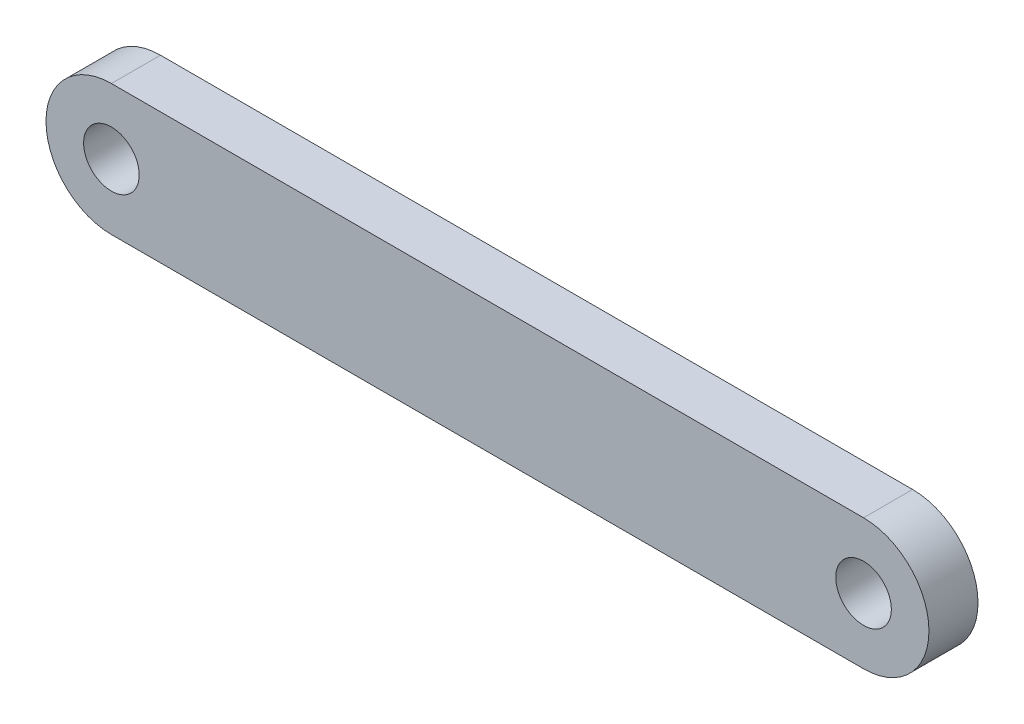
ISO-10303-21;
HEADER;
FILE_DESCRIPTION(('STEP AP214'),'2;1');
FILE_NAME('part.step','',(''),(''),'','','');
FILE_SCHEMA(('AUTOMOTIVE_DESIGN { 1 0 10303 214 1 1 1 1 }'));
ENDSEC;
DATA;
#1=APPLICATION_CONTEXT('core data for automotive mechanical design processes');
#2=APPLICATION_PROTOCOL_DEFINITION('international standard','automotive_design',2000,#1);
#3=PRODUCT_CONTEXT('',#1,'mechanical');
#4=PRODUCT('Part','Part','',(#3));
#5=PRODUCT_RELATED_PRODUCT_CATEGORY('part','',(#4));
#6=PRODUCT_DEFINITION_FORMATION('','',#4);
#7=PRODUCT_DEFINITION_CONTEXT('part definition',#1,'design');
#8=PRODUCT_DEFINITION('design','',#6,#7);
#9=PRODUCT_DEFINITION_SHAPE('','',#8);
#10=(LENGTH_UNIT() NAMED_UNIT(*) SI_UNIT(.MILLI.,.METRE.));
#11=(NAMED_UNIT(*) PLANE_ANGLE_UNIT() SI_UNIT($,.RADIAN.));
#12=(NAMED_UNIT(*) SI_UNIT($,.STERADIAN.) SOLID_ANGLE_UNIT());
#13=UNCERTAINTY_MEASURE_WITH_UNIT(LENGTH_MEASURE(1.E-05),#10,'distance_accuracy_value','');
#14=(GEOMETRIC_REPRESENTATION_CONTEXT(3) GLOBAL_UNCERTAINTY_ASSIGNED_CONTEXT((#13)) GLOBAL_UNIT_ASSIGNED_CONTEXT((#10,
#11,#12)) REPRESENTATION_CONTEXT('',''));
#15=CARTESIAN_POINT('',(0.,0.,0.));
#16=DIRECTION('',(0.,0.,1.));
#17=DIRECTION('',(1.,0.,0.));
#18=AXIS2_PLACEMENT_3D('',#15,#16,#17);
#19=CARTESIAN_POINT('',(4.,4.,3.));
#20=DIRECTION('',(0.,0.,-1.));
#21=DIRECTION('',(-1.,0.,0.));
#22=AXIS2_PLACEMENT_3D('',#19,#20,#21);
#23=PLANE('',#22);
#24=CARTESIAN_POINT('',(4.,4.,3.));
#25=DIRECTION('',(0.,0.,1.));
#26=DIRECTION('',(-1.,0.,0.));
#27=AXIS2_PLACEMENT_3D('',#24,#25,#26);
#28=CIRCLE('',#27,4.);
#29=CARTESIAN_POINT('',(4.,8.,3.));
#30=VERTEX_POINT('',#29);
#31=CARTESIAN_POINT('',(4.,0.,3.));
#32=VERTEX_POINT('',#31);
#33=EDGE_CURVE('E93',#30,#32,#28,.T.);
#34=ORIENTED_EDGE('',*,*,#33,.T.);
#35=DIRECTION('',(1.,0.,0.));
#36=VECTOR('',#35,1.);
#37=CARTESIAN_POINT('',(4.,0.,3.));
#38=LINE('',#37,#36);
#39=CARTESIAN_POINT('',(50.,0.,3.));
#40=VERTEX_POINT('',#39);
#41=EDGE_CURVE('E88',#32,#40,#38,.T.);
#42=ORIENTED_EDGE('',*,*,#41,.T.);
#43=CARTESIAN_POINT('',(50.,4.,3.));
#44=DIRECTION('',(0.,0.,1.));
#45=DIRECTION('',(-1.,0.,0.));
#46=AXIS2_PLACEMENT_3D('',#43,#44,#45);
#47=CIRCLE('',#46,4.);
#48=CARTESIAN_POINT('',(50.,8.,3.));
#49=VERTEX_POINT('',#48);
#50=EDGE_CURVE('E91',#40,#49,#47,.T.);
#51=ORIENTED_EDGE('',*,*,#50,.T.);
#52=DIRECTION('',(-1.,0.,0.));
#53=VECTOR('',#52,1.);
#54=CARTESIAN_POINT('',(50.,8.,3.));
#55=LINE('',#54,#53);
#56=EDGE_CURVE('E58',#49,#30,#55,.T.);
#57=ORIENTED_EDGE('',*,*,#56,.T.);
#58=EDGE_LOOP('',(#34,#42,#51,#57));
#59=FACE_BOUND('',#58,.T.);
#60=CARTESIAN_POINT('',(50.,4.,3.));
#61=DIRECTION('',(0.,0.,1.));
#62=DIRECTION('',(1.,0.,0.));
#63=AXIS2_PLACEMENT_3D('',#60,#61,#62);
#64=CIRCLE('',#63,1.7);
#65=CARTESIAN_POINT('',(51.7,4.,3.));
#66=VERTEX_POINT('',#65);
#67=EDGE_CURVE('E108',#66,#66,#64,.T.);
#68=ORIENTED_EDGE('',*,*,#67,.F.);
#69=EDGE_LOOP('',(#68));
#70=FACE_BOUND('',#69,.T.);
#71=CARTESIAN_POINT('',(4.,4.,3.));
#72=DIRECTION('',(0.,0.,1.));
#73=DIRECTION('',(1.,0.,0.));
#74=AXIS2_PLACEMENT_3D('',#71,#72,#73);
#75=CIRCLE('',#74,1.7);
#76=CARTESIAN_POINT('',(5.7,4.,3.));
#77=VERTEX_POINT('',#76);
#78=EDGE_CURVE('E123',#77,#77,#75,.T.);
#79=ORIENTED_EDGE('',*,*,#78,.F.);
#80=EDGE_LOOP('',(#79));
#81=FACE_BOUND('',#80,.T.);
#82=ADVANCED_FACE('F41',(#59,#70,#81),#23,.F.);
#83=CARTESIAN_POINT('',(4.,4.,0.));
#84=DIRECTION('',(0.,0.,-1.));
#85=DIRECTION('',(-1.,0.,0.));
#86=AXIS2_PLACEMENT_3D('',#83,#84,#85);
#87=PLANE('',#86);
#88=CARTESIAN_POINT('',(50.,4.,0.));
#89=DIRECTION('',(0.,0.,1.));
#90=DIRECTION('',(1.,0.,0.));
#91=AXIS2_PLACEMENT_3D('',#88,#89,#90);
#92=CIRCLE('',#91,1.7);
#93=CARTESIAN_POINT('',(51.7,4.,0.));
#94=VERTEX_POINT('',#93);
#95=EDGE_CURVE('E120',#94,#94,#92,.T.);
#96=ORIENTED_EDGE('',*,*,#95,.T.);
#97=EDGE_LOOP('',(#96));
#98=FACE_BOUND('',#97,.T.);
#99=CARTESIAN_POINT('',(4.,4.,0.));
#100=DIRECTION('',(0.,0.,1.));
#101=DIRECTION('',(-1.,0.,0.));
#102=AXIS2_PLACEMENT_3D('',#99,#100,#101);
#103=CIRCLE('',#102,4.);
#104=CARTESIAN_POINT('',(4.,8.,0.));
#105=VERTEX_POINT('',#104);
#106=CARTESIAN_POINT('',(4.,0.,0.));
#107=VERTEX_POINT('',#106);
#108=EDGE_CURVE('E105',#105,#107,#103,.T.);
#109=ORIENTED_EDGE('',*,*,#108,.F.);
#110=DIRECTION('',(-1.,0.,0.));
#111=VECTOR('',#110,1.);
#112=CARTESIAN_POINT('',(50.,8.,0.));
#113=LINE('',#112,#111);
#114=CARTESIAN_POINT('',(50.,8.,0.));
#115=VERTEX_POINT('',#114);
#116=EDGE_CURVE('E81',#115,#105,#113,.T.);
#117=ORIENTED_EDGE('',*,*,#116,.F.);
#118=CARTESIAN_POINT('',(50.,4.,0.));
#119=DIRECTION('',(0.,0.,1.));
#120=DIRECTION('',(-1.,0.,0.));
#121=AXIS2_PLACEMENT_3D('',#118,#119,#120);
#122=CIRCLE('',#121,4.);
#123=CARTESIAN_POINT('',(50.,0.,0.));
#124=VERTEX_POINT('',#123);
#125=EDGE_CURVE('E75',#124,#115,#122,.T.);
#126=ORIENTED_EDGE('',*,*,#125,.F.);
#127=DIRECTION('',(1.,0.,0.));
#128=VECTOR('',#127,1.);
#129=CARTESIAN_POINT('',(4.,0.,0.));
#130=LINE('',#129,#128);
#131=EDGE_CURVE('E97',#107,#124,#130,.T.);
#132=ORIENTED_EDGE('',*,*,#131,.F.);
#133=EDGE_LOOP('',(#109,#117,#126,#132));
#134=FACE_BOUND('',#133,.T.);
#135=CARTESIAN_POINT('',(4.,4.,0.));
#136=DIRECTION('',(0.,0.,1.));
#137=DIRECTION('',(1.,0.,0.));
#138=AXIS2_PLACEMENT_3D('',#135,#136,#137);
#139=CIRCLE('',#138,1.7);
#140=CARTESIAN_POINT('',(5.7,4.,0.));
#141=VERTEX_POINT('',#140);
#142=EDGE_CURVE('E126',#141,#141,#139,.T.);
#143=ORIENTED_EDGE('',*,*,#142,.T.);
#144=EDGE_LOOP('',(#143));
#145=FACE_BOUND('',#144,.T.);
#146=ADVANCED_FACE('F116',(#98,#134,#145),#87,.T.);
#147=CARTESIAN_POINT('',(4.,4.,3.));
#148=DIRECTION('',(0.,0.,-1.));
#149=DIRECTION('',(-1.,0.,0.));
#150=AXIS2_PLACEMENT_3D('',#147,#148,#149);
#151=CYLINDRICAL_SURFACE('',#150,4.);
#152=ORIENTED_EDGE('',*,*,#108,.T.);
#153=DIRECTION('',(0.,0.,-1.));
#154=VECTOR('',#153,1.);
#155=CARTESIAN_POINT('',(4.,0.,3.));
#156=LINE('',#155,#154);
#157=EDGE_CURVE('E11',#32,#107,#156,.T.);
#158=ORIENTED_EDGE('',*,*,#157,.F.);
#159=ORIENTED_EDGE('',*,*,#33,.F.);
#160=DIRECTION('',(0.,0.,-1.));
#161=VECTOR('',#160,1.);
#162=CARTESIAN_POINT('',(4.,8.,3.));
#163=LINE('',#162,#161);
#164=EDGE_CURVE('E101',#30,#105,#163,.T.);
#165=ORIENTED_EDGE('',*,*,#164,.T.);
#166=EDGE_LOOP('',(#152,#158,#159,#165));
#167=FACE_BOUND('',#166,.T.);
#168=ADVANCED_FACE('F43',(#167),#151,.T.);
#169=CARTESIAN_POINT('',(4.,0.,3.));
#170=DIRECTION('',(0.,1.,0.));
#171=DIRECTION('',(-1.,0.,0.));
#172=AXIS2_PLACEMENT_3D('',#169,#170,#171);
#173=PLANE('',#172);
#174=ORIENTED_EDGE('',*,*,#131,.T.);
#175=DIRECTION('',(0.,0.,-1.));
#176=VECTOR('',#175,1.);
#177=CARTESIAN_POINT('',(50.,0.,3.));
#178=LINE('',#177,#176);
#179=EDGE_CURVE('E50',#40,#124,#178,.T.);
#180=ORIENTED_EDGE('',*,*,#179,.F.);
#181=ORIENTED_EDGE('',*,*,#41,.F.);
#182=ORIENTED_EDGE('',*,*,#157,.T.);
#183=EDGE_LOOP('',(#174,#180,#181,#182));
#184=FACE_BOUND('',#183,.T.);
#185=ADVANCED_FACE('F96',(#184),#173,.F.);
#186=CARTESIAN_POINT('',(50.,4.,3.));
#187=DIRECTION('',(0.,0.,-1.));
#188=DIRECTION('',(-1.,0.,0.));
#189=AXIS2_PLACEMENT_3D('',#186,#187,#188);
#190=CYLINDRICAL_SURFACE('',#189,4.);
#191=ORIENTED_EDGE('',*,*,#125,.T.);
#192=DIRECTION('',(0.,0.,-1.));
#193=VECTOR('',#192,1.);
#194=CARTESIAN_POINT('',(50.,8.,3.));
#195=LINE('',#194,#193);
#196=EDGE_CURVE('E98',#49,#115,#195,.T.);
#197=ORIENTED_EDGE('',*,*,#196,.F.);
#198=ORIENTED_EDGE('',*,*,#50,.F.);
#199=ORIENTED_EDGE('',*,*,#179,.T.);
#200=EDGE_LOOP('',(#191,#197,#198,#199));
#201=FACE_BOUND('',#200,.T.);
#202=ADVANCED_FACE('F99',(#201),#190,.T.);
#203=CARTESIAN_POINT('',(50.,8.,3.));
#204=DIRECTION('',(0.,-1.,0.));
#205=DIRECTION('',(1.,0.,0.));
#206=AXIS2_PLACEMENT_3D('',#203,#204,#205);
#207=PLANE('',#206);
#208=ORIENTED_EDGE('',*,*,#116,.T.);
#209=ORIENTED_EDGE('',*,*,#164,.F.);
#210=ORIENTED_EDGE('',*,*,#56,.F.);
#211=ORIENTED_EDGE('',*,*,#196,.T.);
#212=EDGE_LOOP('',(#208,#209,#210,#211));
#213=FACE_BOUND('',#212,.T.);
#214=ADVANCED_FACE('F113',(#213),#207,.F.);
#215=CARTESIAN_POINT('',(50.,4.,3.));
#216=DIRECTION('',(0.,0.,-1.));
#217=DIRECTION('',(-1.,0.,0.));
#218=AXIS2_PLACEMENT_3D('',#215,#216,#217);
#219=CYLINDRICAL_SURFACE('',#218,1.7);
#220=ORIENTED_EDGE('',*,*,#67,.T.);
#221=EDGE_LOOP('',(#220));
#222=FACE_BOUND('',#221,.T.);
#223=ORIENTED_EDGE('',*,*,#95,.F.);
#224=EDGE_LOOP('',(#223));
#225=FACE_BOUND('',#224,.T.);
#226=ADVANCED_FACE('F143',(#222,#225),#219,.F.);
#227=CARTESIAN_POINT('',(4.,4.,3.));
#228=DIRECTION('',(0.,0.,-1.));
#229=DIRECTION('',(-1.,0.,0.));
#230=AXIS2_PLACEMENT_3D('',#227,#228,#229);
#231=CYLINDRICAL_SURFACE('',#230,1.7);
#232=ORIENTED_EDGE('',*,*,#78,.T.);
#233=EDGE_LOOP('',(#232));
#234=FACE_BOUND('',#233,.T.);
#235=ORIENTED_EDGE('',*,*,#142,.F.);
#236=EDGE_LOOP('',(#235));
#237=FACE_BOUND('',#236,.T.);
#238=ADVANCED_FACE('F132',(#234,#237),#231,.F.);
#239=CLOSED_SHELL('',(#82,#146,#168,#185,#202,#214,#226,#238));
#240=MANIFOLD_SOLID_BREP('B2',#239);
#241=ADVANCED_BREP_SHAPE_REPRESENTATION('',(#18,#240),#14);
#242=SHAPE_DEFINITION_REPRESENTATION(#9,#241);
ENDSEC;
END-ISO-10303-21;
